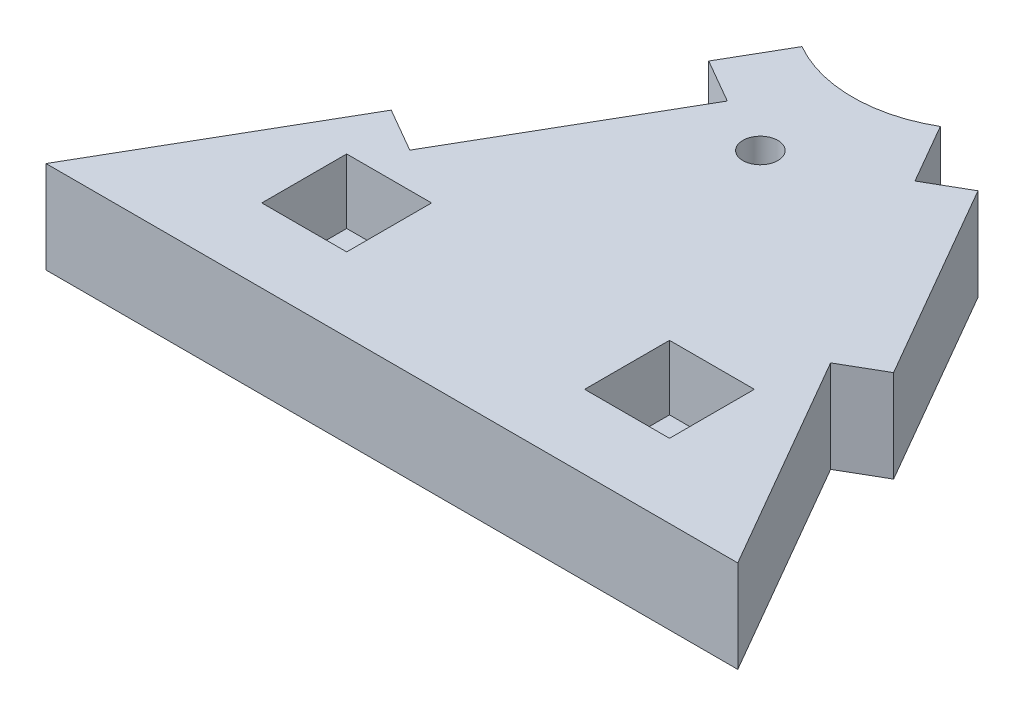
ISO-10303-21;
HEADER;
FILE_DESCRIPTION(('STEP AP214'),'2;1');
FILE_NAME('part.step','',(''),(''),'','','');
FILE_SCHEMA(('AUTOMOTIVE_DESIGN { 1 0 10303 214 1 1 1 1 }'));
ENDSEC;
DATA;
#1=APPLICATION_CONTEXT('core data for automotive mechanical design processes');
#2=APPLICATION_PROTOCOL_DEFINITION('international standard','automotive_design',2000,#1);
#3=PRODUCT_CONTEXT('',#1,'mechanical');
#4=PRODUCT('Part','Part','',(#3));
#5=PRODUCT_RELATED_PRODUCT_CATEGORY('part','',(#4));
#6=PRODUCT_DEFINITION_FORMATION('','',#4);
#7=PRODUCT_DEFINITION_CONTEXT('part definition',#1,'design');
#8=PRODUCT_DEFINITION('design','',#6,#7);
#9=PRODUCT_DEFINITION_SHAPE('','',#8);
#10=(LENGTH_UNIT() NAMED_UNIT(*) SI_UNIT(.MILLI.,.METRE.));
#11=(NAMED_UNIT(*) PLANE_ANGLE_UNIT() SI_UNIT($,.RADIAN.));
#12=(NAMED_UNIT(*) SI_UNIT($,.STERADIAN.) SOLID_ANGLE_UNIT());
#13=UNCERTAINTY_MEASURE_WITH_UNIT(LENGTH_MEASURE(1.E-05),#10,'distance_accuracy_value','');
#14=(GEOMETRIC_REPRESENTATION_CONTEXT(3) GLOBAL_UNCERTAINTY_ASSIGNED_CONTEXT((#13)) GLOBAL_UNIT_ASSIGNED_CONTEXT((#10,
#11,#12)) REPRESENTATION_CONTEXT('',''));
#15=CARTESIAN_POINT('',(0.,0.,0.));
#16=DIRECTION('',(0.,0.,1.));
#17=DIRECTION('',(1.,0.,0.));
#18=AXIS2_PLACEMENT_3D('',#15,#16,#17);
#19=CARTESIAN_POINT('',(75.,10.,0.));
#20=DIRECTION('',(-0.866025403784439,0.,0.5));
#21=DIRECTION('',(0.5,0.,0.866025403784439));
#22=AXIS2_PLACEMENT_3D('',#19,#20,#21);
#23=PLANE('',#22);
#24=DIRECTION('',(-0.5,0.,-0.866025403784439));
#25=VECTOR('',#24,1.);
#26=CARTESIAN_POINT('',(75.,0.,0.));
#27=LINE('',#26,#25);
#28=CARTESIAN_POINT('',(48.75,0.,-45.466333698683));
#29=VERTEX_POINT('',#28);
#30=CARTESIAN_POINT('',(45.,0.,-51.9615242270663));
#31=VERTEX_POINT('',#30);
#32=EDGE_CURVE('E194',#29,#31,#27,.T.);
#33=ORIENTED_EDGE('',*,*,#32,.T.);
#34=DIRECTION('',(0.,1.,0.));
#35=VECTOR('',#34,1.);
#36=CARTESIAN_POINT('',(45.,0.,-51.9615242270663));
#37=LINE('',#36,#35);
#38=CARTESIAN_POINT('',(45.,10.,-51.9615242270663));
#39=VERTEX_POINT('',#38);
#40=EDGE_CURVE('E48',#31,#39,#37,.T.);
#41=ORIENTED_EDGE('',*,*,#40,.T.);
#42=DIRECTION('',(-0.5,0.,-0.866025403784439));
#43=VECTOR('',#42,1.);
#44=CARTESIAN_POINT('',(75.,10.,0.));
#45=LINE('',#44,#43);
#46=CARTESIAN_POINT('',(48.75,10.,-45.466333698683));
#47=VERTEX_POINT('',#46);
#48=EDGE_CURVE('E55',#47,#39,#45,.T.);
#49=ORIENTED_EDGE('',*,*,#48,.F.);
#50=DIRECTION('',(0.,1.,0.));
#51=VECTOR('',#50,1.);
#52=CARTESIAN_POINT('',(48.75,0.,-45.466333698683));
#53=LINE('',#52,#51);
#54=EDGE_CURVE('E298',#29,#47,#53,.T.);
#55=ORIENTED_EDGE('',*,*,#54,.F.);
#56=EDGE_LOOP('',(#33,#41,#49,#55));
#57=FACE_BOUND('',#56,.T.);
#58=ADVANCED_FACE('F33',(#57),#23,.F.);
#59=CARTESIAN_POINT('',(37.5,10.,-64.9519052838329));
#60=DIRECTION('',(0.866025403784439,0.,0.5));
#61=DIRECTION('',(0.5,0.,-0.866025403784439));
#62=AXIS2_PLACEMENT_3D('',#59,#60,#61);
#63=PLANE('',#62);
#64=DIRECTION('',(-0.5,0.,0.866025403784439));
#65=VECTOR('',#64,1.);
#66=CARTESIAN_POINT('',(37.5,10.,-64.9519052838329));
#67=LINE('',#66,#65);
#68=CARTESIAN_POINT('',(30.,10.,-51.9615242270663));
#69=VERTEX_POINT('',#68);
#70=CARTESIAN_POINT('',(26.3,10.,-45.5529362390615));
#71=VERTEX_POINT('',#70);
#72=EDGE_CURVE('E184',#69,#71,#67,.T.);
#73=ORIENTED_EDGE('',*,*,#72,.F.);
#74=DIRECTION('',(0.,1.,0.));
#75=VECTOR('',#74,1.);
#76=CARTESIAN_POINT('',(30.,0.,-51.9615242270663));
#77=LINE('',#76,#75);
#78=CARTESIAN_POINT('',(30.,0.,-51.9615242270663));
#79=VERTEX_POINT('',#78);
#80=EDGE_CURVE('E171',#79,#69,#77,.T.);
#81=ORIENTED_EDGE('',*,*,#80,.F.);
#82=DIRECTION('',(-0.5,0.,0.866025403784439));
#83=VECTOR('',#82,1.);
#84=CARTESIAN_POINT('',(37.5,0.,-64.9519052838329));
#85=LINE('',#84,#83);
#86=CARTESIAN_POINT('',(26.3,0.,-45.5529362390615));
#87=VERTEX_POINT('',#86);
#88=EDGE_CURVE('E182',#79,#87,#85,.T.);
#89=ORIENTED_EDGE('',*,*,#88,.T.);
#90=DIRECTION('',(0.,1.,0.));
#91=VECTOR('',#90,1.);
#92=CARTESIAN_POINT('',(26.3,0.,-45.5529362390615));
#93=LINE('',#92,#91);
#94=EDGE_CURVE('E270',#87,#71,#93,.T.);
#95=ORIENTED_EDGE('',*,*,#94,.T.);
#96=EDGE_LOOP('',(#73,#81,#89,#95));
#97=FACE_BOUND('',#96,.T.);
#98=ADVANCED_FACE('F180',(#97),#63,.F.);
#99=CARTESIAN_POINT('',(13.7,10.,-23.7290960636936));
#100=VERTEX_POINT('',#99);
#101=CARTESIAN_POINT('',(0.,10.,0.));
#102=VERTEX_POINT('',#101);
#103=EDGE_CURVE('E202',#100,#102,#67,.T.);
#104=ORIENTED_EDGE('',*,*,#103,.F.);
#105=DIRECTION('',(0.,1.,0.));
#106=VECTOR('',#105,1.);
#107=CARTESIAN_POINT('',(13.7,0.,-23.7290960636936));
#108=LINE('',#107,#106);
#109=CARTESIAN_POINT('',(13.7,0.,-23.7290960636936));
#110=VERTEX_POINT('',#109);
#111=EDGE_CURVE('E281',#110,#100,#108,.T.);
#112=ORIENTED_EDGE('',*,*,#111,.F.);
#113=CARTESIAN_POINT('',(0.,0.,0.));
#114=VERTEX_POINT('',#113);
#115=EDGE_CURVE('E192',#110,#114,#85,.T.);
#116=ORIENTED_EDGE('',*,*,#115,.T.);
#117=DIRECTION('',(0.,-1.,0.));
#118=VECTOR('',#117,1.);
#119=CARTESIAN_POINT('',(0.,10.,0.));
#120=LINE('',#119,#118);
#121=EDGE_CURVE('E11',#102,#114,#120,.T.);
#122=ORIENTED_EDGE('',*,*,#121,.F.);
#123=EDGE_LOOP('',(#104,#112,#116,#122));
#124=FACE_BOUND('',#123,.T.);
#125=ADVANCED_FACE('F35',(#124),#63,.F.);
#126=CARTESIAN_POINT('',(0.,10.,0.));
#127=DIRECTION('',(0.,0.,-1.));
#128=DIRECTION('',(-1.,0.,0.));
#129=AXIS2_PLACEMENT_3D('',#126,#127,#128);
#130=PLANE('',#129);
#131=DIRECTION('',(1.,0.,0.));
#132=VECTOR('',#131,1.);
#133=CARTESIAN_POINT('',(0.,0.,0.));
#134=LINE('',#133,#132);
#135=CARTESIAN_POINT('',(75.,0.,0.));
#136=VERTEX_POINT('',#135);
#137=EDGE_CURVE('E191',#114,#136,#134,.T.);
#138=ORIENTED_EDGE('',*,*,#137,.T.);
#139=DIRECTION('',(0.,-1.,0.));
#140=VECTOR('',#139,1.);
#141=CARTESIAN_POINT('',(75.,10.,0.));
#142=LINE('',#141,#140);
#143=CARTESIAN_POINT('',(75.,10.,0.));
#144=VERTEX_POINT('',#143);
#145=EDGE_CURVE('E41',#144,#136,#142,.T.);
#146=ORIENTED_EDGE('',*,*,#145,.F.);
#147=DIRECTION('',(1.,0.,0.));
#148=VECTOR('',#147,1.);
#149=CARTESIAN_POINT('',(0.,10.,0.));
#150=LINE('',#149,#148);
#151=EDGE_CURVE('E212',#102,#144,#150,.T.);
#152=ORIENTED_EDGE('',*,*,#151,.F.);
#153=ORIENTED_EDGE('',*,*,#121,.T.);
#154=EDGE_LOOP('',(#138,#146,#152,#153));
#155=FACE_BOUND('',#154,.T.);
#156=ADVANCED_FACE('F385',(#155),#130,.F.);
#157=CARTESIAN_POINT('',(61.25,0.,-23.8156986040721));
#158=VERTEX_POINT('',#157);
#159=EDGE_CURVE('E201',#136,#158,#27,.T.);
#160=ORIENTED_EDGE('',*,*,#159,.T.);
#161=DIRECTION('',(0.,1.,0.));
#162=VECTOR('',#161,1.);
#163=CARTESIAN_POINT('',(61.25,0.,-23.8156986040721));
#164=LINE('',#163,#162);
#165=CARTESIAN_POINT('',(61.25,10.,-23.8156986040721));
#166=VERTEX_POINT('',#165);
#167=EDGE_CURVE('E304',#158,#166,#164,.T.);
#168=ORIENTED_EDGE('',*,*,#167,.T.);
#169=EDGE_CURVE('E198',#144,#166,#45,.T.);
#170=ORIENTED_EDGE('',*,*,#169,.F.);
#171=ORIENTED_EDGE('',*,*,#145,.T.);
#172=EDGE_LOOP('',(#160,#168,#170,#171));
#173=FACE_BOUND('',#172,.T.);
#174=ADVANCED_FACE('F345',(#173),#23,.F.);
#175=CARTESIAN_POINT('',(0.,10.,0.));
#176=DIRECTION('',(0.,1.,0.));
#177=DIRECTION('',(0.,0.,1.));
#178=AXIS2_PLACEMENT_3D('',#175,#176,#177);
#179=PLANE('',#178);
#180=CARTESIAN_POINT('',(37.5000000000003,10.,-39.9519052838329));
#181=DIRECTION('',(0.,1.,0.));
#182=DIRECTION('',(0.,0.,1.));
#183=AXIS2_PLACEMENT_3D('',#180,#181,#182);
#184=CIRCLE('',#183,1.9);
#185=CARTESIAN_POINT('',(37.5000000000003,10.,-38.0519052838329));
#186=VERTEX_POINT('',#185);
#187=EDGE_CURVE('E330',#186,#186,#184,.T.);
#188=ORIENTED_EDGE('',*,*,#187,.F.);
#189=EDGE_LOOP('',(#188));
#190=FACE_BOUND('',#189,.T.);
#191=CARTESIAN_POINT('',(37.5,10.,-64.9519052838329));
#192=DIRECTION('',(0.,1.,0.));
#193=DIRECTION('',(0.,0.,1.));
#194=AXIS2_PLACEMENT_3D('',#191,#192,#193);
#195=CIRCLE('',#194,15.);
#196=EDGE_CURVE('E176',#69,#39,#195,.T.);
#197=ORIENTED_EDGE('',*,*,#196,.F.);
#198=ORIENTED_EDGE('',*,*,#72,.T.);
#199=DIRECTION('',(-0.866025403784438,0.,-0.500000000000001));
#200=VECTOR('',#199,1.);
#201=CARTESIAN_POINT('',(26.3,10.,-45.5529362390615));
#202=LINE('',#201,#200);
#203=CARTESIAN_POINT('',(31.0631397208144,10.,-42.8029362390615));
#204=VERTEX_POINT('',#203);
#205=EDGE_CURVE('E288',#204,#71,#202,.T.);
#206=ORIENTED_EDGE('',*,*,#205,.F.);
#207=DIRECTION('',(0.5,0.,-0.866025403784439));
#208=VECTOR('',#207,1.);
#209=CARTESIAN_POINT('',(31.0631397208144,10.,-42.8029362390615));
#210=LINE('',#209,#208);
#211=CARTESIAN_POINT('',(18.4631397208144,10.,-20.9790960636936));
#212=VERTEX_POINT('',#211);
#213=EDGE_CURVE('E292',#212,#204,#210,.T.);
#214=ORIENTED_EDGE('',*,*,#213,.F.);
#215=DIRECTION('',(0.866025403784438,0.,0.500000000000001));
#216=VECTOR('',#215,1.);
#217=CARTESIAN_POINT('',(18.4631397208144,10.,-20.9790960636936));
#218=LINE('',#217,#216);
#219=EDGE_CURVE('E295',#100,#212,#218,.T.);
#220=ORIENTED_EDGE('',*,*,#219,.F.);
#221=ORIENTED_EDGE('',*,*,#103,.T.);
#222=ORIENTED_EDGE('',*,*,#151,.T.);
#223=ORIENTED_EDGE('',*,*,#169,.T.);
#224=DIRECTION('',(0.866025403784438,0.,-0.500000000000001));
#225=VECTOR('',#224,1.);
#226=CARTESIAN_POINT('',(65.5801270189222,10.,-26.3156986040721));
#227=LINE('',#226,#225);
#228=CARTESIAN_POINT('',(65.5801270189222,10.,-26.3156986040721));
#229=VERTEX_POINT('',#228);
#230=EDGE_CURVE('E318',#166,#229,#227,.T.);
#231=ORIENTED_EDGE('',*,*,#230,.T.);
#232=DIRECTION('',(-0.5,0.,-0.866025403784439));
#233=VECTOR('',#232,1.);
#234=CARTESIAN_POINT('',(53.0801270189222,10.,-47.966333698683));
#235=LINE('',#234,#233);
#236=CARTESIAN_POINT('',(53.0801270189222,10.,-47.966333698683));
#237=VERTEX_POINT('',#236);
#238=EDGE_CURVE('E315',#229,#237,#235,.T.);
#239=ORIENTED_EDGE('',*,*,#238,.T.);
#240=DIRECTION('',(-0.866025403784438,0.,0.500000000000002));
#241=VECTOR('',#240,1.);
#242=CARTESIAN_POINT('',(48.75,10.,-45.466333698683));
#243=LINE('',#242,#241);
#244=EDGE_CURVE('E312',#237,#47,#243,.T.);
#245=ORIENTED_EDGE('',*,*,#244,.T.);
#246=ORIENTED_EDGE('',*,*,#48,.T.);
#247=EDGE_LOOP('',(#197,#198,#206,#214,#220,#221,#222,#223,#231,#239,#245,#246));
#248=FACE_BOUND('',#247,.T.);
#249=DIRECTION('',(1.,0.,0.));
#250=VECTOR('',#249,1.);
#251=CARTESIAN_POINT('',(59.6,10.,-8.00000000000001));
#252=LINE('',#251,#250);
#253=CARTESIAN_POINT('',(50.4,10.,-8.));
#254=VERTEX_POINT('',#253);
#255=CARTESIAN_POINT('',(59.6,10.,-8.00000000000001));
#256=VERTEX_POINT('',#255);
#257=EDGE_CURVE('E268',#254,#256,#252,.T.);
#258=ORIENTED_EDGE('',*,*,#257,.F.);
#259=DIRECTION('',(0.,0.,1.));
#260=VECTOR('',#259,1.);
#261=CARTESIAN_POINT('',(50.4,10.,-8.));
#262=LINE('',#261,#260);
#263=CARTESIAN_POINT('',(50.4,10.,-17.2));
#264=VERTEX_POINT('',#263);
#265=EDGE_CURVE('E258',#264,#254,#262,.T.);
#266=ORIENTED_EDGE('',*,*,#265,.F.);
#267=DIRECTION('',(-1.,0.,0.));
#268=VECTOR('',#267,1.);
#269=CARTESIAN_POINT('',(59.6,10.,-17.2));
#270=LINE('',#269,#268);
#271=CARTESIAN_POINT('',(59.6,10.,-17.2));
#272=VERTEX_POINT('',#271);
#273=EDGE_CURVE('E262',#272,#264,#270,.T.);
#274=ORIENTED_EDGE('',*,*,#273,.F.);
#275=DIRECTION('',(0.,0.,-1.));
#276=VECTOR('',#275,1.);
#277=CARTESIAN_POINT('',(59.6,10.,-8.00000000000001));
#278=LINE('',#277,#276);
#279=EDGE_CURVE('E265',#256,#272,#278,.T.);
#280=ORIENTED_EDGE('',*,*,#279,.F.);
#281=EDGE_LOOP('',(#258,#266,#274,#280));
#282=FACE_BOUND('',#281,.T.);
#283=DIRECTION('',(0.,0.,-1.));
#284=VECTOR('',#283,1.);
#285=CARTESIAN_POINT('',(24.6,10.,-8.));
#286=LINE('',#285,#284);
#287=CARTESIAN_POINT('',(24.6,10.,-8.));
#288=VERTEX_POINT('',#287);
#289=CARTESIAN_POINT('',(24.6,10.,-17.2));
#290=VERTEX_POINT('',#289);
#291=EDGE_CURVE('E236',#288,#290,#286,.T.);
#292=ORIENTED_EDGE('',*,*,#291,.F.);
#293=DIRECTION('',(1.,0.,0.));
#294=VECTOR('',#293,1.);
#295=CARTESIAN_POINT('',(15.4,10.,-8.));
#296=LINE('',#295,#294);
#297=CARTESIAN_POINT('',(15.4,10.,-8.));
#298=VERTEX_POINT('',#297);
#299=EDGE_CURVE('E226',#298,#288,#296,.T.);
#300=ORIENTED_EDGE('',*,*,#299,.F.);
#301=DIRECTION('',(0.,0.,1.));
#302=VECTOR('',#301,1.);
#303=CARTESIAN_POINT('',(15.4,10.,-8.));
#304=LINE('',#303,#302);
#305=CARTESIAN_POINT('',(15.4,10.,-17.2));
#306=VERTEX_POINT('',#305);
#307=EDGE_CURVE('E230',#306,#298,#304,.T.);
#308=ORIENTED_EDGE('',*,*,#307,.F.);
#309=DIRECTION('',(-1.,0.,0.));
#310=VECTOR('',#309,1.);
#311=CARTESIAN_POINT('',(15.4,10.,-17.2));
#312=LINE('',#311,#310);
#313=EDGE_CURVE('E233',#290,#306,#312,.T.);
#314=ORIENTED_EDGE('',*,*,#313,.F.);
#315=EDGE_LOOP('',(#292,#300,#308,#314));
#316=FACE_BOUND('',#315,.T.);
#317=ADVANCED_FACE('F343',(#190,#248,#282,#316),#179,.T.);
#318=CARTESIAN_POINT('',(0.,0.,0.));
#319=DIRECTION('',(0.,1.,0.));
#320=DIRECTION('',(0.,0.,1.));
#321=AXIS2_PLACEMENT_3D('',#318,#319,#320);
#322=PLANE('',#321);
#323=CARTESIAN_POINT('',(37.5000000000003,0.,-39.9519052838329));
#324=DIRECTION('',(0.,1.,0.));
#325=DIRECTION('',(0.,0.,1.));
#326=AXIS2_PLACEMENT_3D('',#323,#324,#325);
#327=CIRCLE('',#326,1.9);
#328=CARTESIAN_POINT('',(37.5000000000003,0.,-38.0519052838329));
#329=VERTEX_POINT('',#328);
#330=EDGE_CURVE('E328',#329,#329,#327,.T.);
#331=ORIENTED_EDGE('',*,*,#330,.T.);
#332=EDGE_LOOP('',(#331));
#333=FACE_BOUND('',#332,.T.);
#334=ORIENTED_EDGE('',*,*,#88,.F.);
#335=CARTESIAN_POINT('',(37.5,0.,-64.9519052838329));
#336=DIRECTION('',(0.,1.,0.));
#337=DIRECTION('',(0.,0.,1.));
#338=AXIS2_PLACEMENT_3D('',#335,#336,#337);
#339=CIRCLE('',#338,15.);
#340=EDGE_CURVE('E168',#79,#31,#339,.T.);
#341=ORIENTED_EDGE('',*,*,#340,.T.);
#342=ORIENTED_EDGE('',*,*,#32,.F.);
#343=DIRECTION('',(-0.866025403784438,0.,0.500000000000002));
#344=VECTOR('',#343,1.);
#345=CARTESIAN_POINT('',(48.75,0.,-45.466333698683));
#346=LINE('',#345,#344);
#347=CARTESIAN_POINT('',(53.0801270189222,0.,-47.966333698683));
#348=VERTEX_POINT('',#347);
#349=EDGE_CURVE('E307',#348,#29,#346,.T.);
#350=ORIENTED_EDGE('',*,*,#349,.F.);
#351=DIRECTION('',(-0.5,0.,-0.866025403784439));
#352=VECTOR('',#351,1.);
#353=CARTESIAN_POINT('',(53.0801270189222,0.,-47.966333698683));
#354=LINE('',#353,#352);
#355=CARTESIAN_POINT('',(65.5801270189222,0.,-26.3156986040721));
#356=VERTEX_POINT('',#355);
#357=EDGE_CURVE('E322',#356,#348,#354,.T.);
#358=ORIENTED_EDGE('',*,*,#357,.F.);
#359=DIRECTION('',(0.866025403784438,0.,-0.500000000000001));
#360=VECTOR('',#359,1.);
#361=CARTESIAN_POINT('',(65.5801270189222,0.,-26.3156986040721));
#362=LINE('',#361,#360);
#363=EDGE_CURVE('E314',#158,#356,#362,.T.);
#364=ORIENTED_EDGE('',*,*,#363,.F.);
#365=ORIENTED_EDGE('',*,*,#159,.F.);
#366=ORIENTED_EDGE('',*,*,#137,.F.);
#367=ORIENTED_EDGE('',*,*,#115,.F.);
#368=DIRECTION('',(0.866025403784438,0.,0.500000000000001));
#369=VECTOR('',#368,1.);
#370=CARTESIAN_POINT('',(18.4631397208144,0.,-20.9790960636936));
#371=LINE('',#370,#369);
#372=CARTESIAN_POINT('',(18.4631397208144,0.,-20.9790960636936));
#373=VERTEX_POINT('',#372);
#374=EDGE_CURVE('E291',#110,#373,#371,.T.);
#375=ORIENTED_EDGE('',*,*,#374,.T.);
#376=DIRECTION('',(0.5,0.,-0.866025403784439));
#377=VECTOR('',#376,1.);
#378=CARTESIAN_POINT('',(31.0631397208144,0.,-42.8029362390615));
#379=LINE('',#378,#377);
#380=CARTESIAN_POINT('',(31.0631397208144,0.,-42.8029362390615));
#381=VERTEX_POINT('',#380);
#382=EDGE_CURVE('E300',#373,#381,#379,.T.);
#383=ORIENTED_EDGE('',*,*,#382,.T.);
#384=DIRECTION('',(-0.866025403784438,0.,-0.500000000000001));
#385=VECTOR('',#384,1.);
#386=CARTESIAN_POINT('',(26.3,0.,-45.5529362390615));
#387=LINE('',#386,#385);
#388=EDGE_CURVE('E190',#381,#87,#387,.T.);
#389=ORIENTED_EDGE('',*,*,#388,.T.);
#390=EDGE_LOOP('',(#334,#341,#342,#350,#358,#364,#365,#366,#367,#375,#383,#389));
#391=FACE_BOUND('',#390,.T.);
#392=ADVANCED_FACE('F187',(#333,#391),#322,.F.);
#393=CARTESIAN_POINT('',(24.6,3.,-8.));
#394=DIRECTION('',(1.,0.,0.));
#395=DIRECTION('',(0.,0.,-1.));
#396=AXIS2_PLACEMENT_3D('',#393,#394,#395);
#397=PLANE('',#396);
#398=ORIENTED_EDGE('',*,*,#291,.T.);
#399=DIRECTION('',(0.,1.,0.));
#400=VECTOR('',#399,1.);
#401=CARTESIAN_POINT('',(24.6,3.,-17.2));
#402=LINE('',#401,#400);
#403=CARTESIAN_POINT('',(24.6,3.,-17.2));
#404=VERTEX_POINT('',#403);
#405=EDGE_CURVE('E217',#404,#290,#402,.T.);
#406=ORIENTED_EDGE('',*,*,#405,.F.);
#407=DIRECTION('',(0.,0.,-1.));
#408=VECTOR('',#407,1.);
#409=CARTESIAN_POINT('',(24.6,3.,-8.));
#410=LINE('',#409,#408);
#411=CARTESIAN_POINT('',(24.6,3.,-8.));
#412=VERTEX_POINT('',#411);
#413=EDGE_CURVE('E229',#412,#404,#410,.T.);
#414=ORIENTED_EDGE('',*,*,#413,.F.);
#415=DIRECTION('',(0.,1.,0.));
#416=VECTOR('',#415,1.);
#417=CARTESIAN_POINT('',(24.6,3.,-8.));
#418=LINE('',#417,#416);
#419=EDGE_CURVE('E196',#412,#288,#418,.T.);
#420=ORIENTED_EDGE('',*,*,#419,.T.);
#421=EDGE_LOOP('',(#398,#406,#414,#420));
#422=FACE_BOUND('',#421,.T.);
#423=ADVANCED_FACE('F357',(#422),#397,.F.);
#424=CARTESIAN_POINT('',(15.4,3.,-8.));
#425=DIRECTION('',(0.,0.,1.));
#426=DIRECTION('',(1.,0.,0.));
#427=AXIS2_PLACEMENT_3D('',#424,#425,#426);
#428=PLANE('',#427);
#429=ORIENTED_EDGE('',*,*,#299,.T.);
#430=ORIENTED_EDGE('',*,*,#419,.F.);
#431=DIRECTION('',(1.,0.,0.));
#432=VECTOR('',#431,1.);
#433=CARTESIAN_POINT('',(15.4,3.,-8.));
#434=LINE('',#433,#432);
#435=CARTESIAN_POINT('',(15.4,3.,-8.));
#436=VERTEX_POINT('',#435);
#437=EDGE_CURVE('E221',#436,#412,#434,.T.);
#438=ORIENTED_EDGE('',*,*,#437,.F.);
#439=DIRECTION('',(0.,1.,0.));
#440=VECTOR('',#439,1.);
#441=CARTESIAN_POINT('',(15.4,3.,-8.));
#442=LINE('',#441,#440);
#443=EDGE_CURVE('E223',#436,#298,#442,.T.);
#444=ORIENTED_EDGE('',*,*,#443,.T.);
#445=EDGE_LOOP('',(#429,#430,#438,#444));
#446=FACE_BOUND('',#445,.T.);
#447=ADVANCED_FACE('F367',(#446),#428,.F.);
#448=CARTESIAN_POINT('',(15.4,3.,-8.));
#449=DIRECTION('',(-1.,0.,0.));
#450=DIRECTION('',(0.,0.,1.));
#451=AXIS2_PLACEMENT_3D('',#448,#449,#450);
#452=PLANE('',#451);
#453=ORIENTED_EDGE('',*,*,#307,.T.);
#454=ORIENTED_EDGE('',*,*,#443,.F.);
#455=DIRECTION('',(0.,0.,1.));
#456=VECTOR('',#455,1.);
#457=CARTESIAN_POINT('',(15.4,3.,-8.));
#458=LINE('',#457,#456);
#459=CARTESIAN_POINT('',(15.4,3.,-17.2));
#460=VERTEX_POINT('',#459);
#461=EDGE_CURVE('E241',#460,#436,#458,.T.);
#462=ORIENTED_EDGE('',*,*,#461,.F.);
#463=DIRECTION('',(0.,1.,0.));
#464=VECTOR('',#463,1.);
#465=CARTESIAN_POINT('',(15.4,3.,-17.2));
#466=LINE('',#465,#464);
#467=EDGE_CURVE('E220',#460,#306,#466,.T.);
#468=ORIENTED_EDGE('',*,*,#467,.T.);
#469=EDGE_LOOP('',(#453,#454,#462,#468));
#470=FACE_BOUND('',#469,.T.);
#471=ADVANCED_FACE('F369',(#470),#452,.F.);
#472=CARTESIAN_POINT('',(15.4,3.,-17.2));
#473=DIRECTION('',(0.,0.,-1.));
#474=DIRECTION('',(-1.,0.,0.));
#475=AXIS2_PLACEMENT_3D('',#472,#473,#474);
#476=PLANE('',#475);
#477=ORIENTED_EDGE('',*,*,#313,.T.);
#478=ORIENTED_EDGE('',*,*,#467,.F.);
#479=DIRECTION('',(-1.,0.,0.));
#480=VECTOR('',#479,1.);
#481=CARTESIAN_POINT('',(15.4,3.,-17.2));
#482=LINE('',#481,#480);
#483=EDGE_CURVE('E244',#404,#460,#482,.T.);
#484=ORIENTED_EDGE('',*,*,#483,.F.);
#485=ORIENTED_EDGE('',*,*,#405,.T.);
#486=EDGE_LOOP('',(#477,#478,#484,#485));
#487=FACE_BOUND('',#486,.T.);
#488=ADVANCED_FACE('F361',(#487),#476,.F.);
#489=CARTESIAN_POINT('',(0.,3.,0.));
#490=DIRECTION('',(0.,-1.,0.));
#491=DIRECTION('',(0.,0.,-1.));
#492=AXIS2_PLACEMENT_3D('',#489,#490,#491);
#493=PLANE('',#492);
#494=ORIENTED_EDGE('',*,*,#413,.T.);
#495=ORIENTED_EDGE('',*,*,#483,.T.);
#496=ORIENTED_EDGE('',*,*,#461,.T.);
#497=ORIENTED_EDGE('',*,*,#437,.T.);
#498=EDGE_LOOP('',(#494,#495,#496,#497));
#499=FACE_BOUND('',#498,.T.);
#500=ADVANCED_FACE('F364',(#499),#493,.F.);
#501=CARTESIAN_POINT('',(59.6,3.,-8.00000000000001));
#502=DIRECTION('',(0.,0.,1.));
#503=DIRECTION('',(1.,0.,0.));
#504=AXIS2_PLACEMENT_3D('',#501,#502,#503);
#505=PLANE('',#504);
#506=ORIENTED_EDGE('',*,*,#257,.T.);
#507=DIRECTION('',(0.,1.,0.));
#508=VECTOR('',#507,1.);
#509=CARTESIAN_POINT('',(59.6,3.,-8.00000000000001));
#510=LINE('',#509,#508);
#511=CARTESIAN_POINT('',(59.6,3.,-8.00000000000001));
#512=VERTEX_POINT('',#511);
#513=EDGE_CURVE('E249',#512,#256,#510,.T.);
#514=ORIENTED_EDGE('',*,*,#513,.F.);
#515=DIRECTION('',(1.,0.,0.));
#516=VECTOR('',#515,1.);
#517=CARTESIAN_POINT('',(59.6,3.,-8.00000000000001));
#518=LINE('',#517,#516);
#519=CARTESIAN_POINT('',(50.4,3.,-8.));
#520=VERTEX_POINT('',#519);
#521=EDGE_CURVE('E261',#520,#512,#518,.T.);
#522=ORIENTED_EDGE('',*,*,#521,.F.);
#523=DIRECTION('',(0.,1.,0.));
#524=VECTOR('',#523,1.);
#525=CARTESIAN_POINT('',(50.4,3.,-8.));
#526=LINE('',#525,#524);
#527=EDGE_CURVE('E238',#520,#254,#526,.T.);
#528=ORIENTED_EDGE('',*,*,#527,.T.);
#529=EDGE_LOOP('',(#506,#514,#522,#528));
#530=FACE_BOUND('',#529,.T.);
#531=ADVANCED_FACE('F434',(#530),#505,.F.);
#532=CARTESIAN_POINT('',(50.4,3.,-8.));
#533=DIRECTION('',(-1.,0.,0.));
#534=DIRECTION('',(0.,0.,1.));
#535=AXIS2_PLACEMENT_3D('',#532,#533,#534);
#536=PLANE('',#535);
#537=ORIENTED_EDGE('',*,*,#265,.T.);
#538=ORIENTED_EDGE('',*,*,#527,.F.);
#539=DIRECTION('',(0.,0.,1.));
#540=VECTOR('',#539,1.);
#541=CARTESIAN_POINT('',(50.4,3.,-8.));
#542=LINE('',#541,#540);
#543=CARTESIAN_POINT('',(50.4,3.,-17.2));
#544=VERTEX_POINT('',#543);
#545=EDGE_CURVE('E253',#544,#520,#542,.T.);
#546=ORIENTED_EDGE('',*,*,#545,.F.);
#547=DIRECTION('',(0.,1.,0.));
#548=VECTOR('',#547,1.);
#549=CARTESIAN_POINT('',(50.4,3.,-17.2));
#550=LINE('',#549,#548);
#551=EDGE_CURVE('E255',#544,#264,#550,.T.);
#552=ORIENTED_EDGE('',*,*,#551,.T.);
#553=EDGE_LOOP('',(#537,#538,#546,#552));
#554=FACE_BOUND('',#553,.T.);
#555=ADVANCED_FACE('F430',(#554),#536,.F.);
#556=CARTESIAN_POINT('',(59.6,3.,-17.2));
#557=DIRECTION('',(0.,0.,-1.));
#558=DIRECTION('',(-1.,0.,0.));
#559=AXIS2_PLACEMENT_3D('',#556,#557,#558);
#560=PLANE('',#559);
#561=ORIENTED_EDGE('',*,*,#273,.T.);
#562=ORIENTED_EDGE('',*,*,#551,.F.);
#563=DIRECTION('',(-1.,0.,0.));
#564=VECTOR('',#563,1.);
#565=CARTESIAN_POINT('',(59.6,3.,-17.2));
#566=LINE('',#565,#564);
#567=CARTESIAN_POINT('',(59.6,3.,-17.2));
#568=VERTEX_POINT('',#567);
#569=EDGE_CURVE('E273',#568,#544,#566,.T.);
#570=ORIENTED_EDGE('',*,*,#569,.F.);
#571=DIRECTION('',(0.,1.,0.));
#572=VECTOR('',#571,1.);
#573=CARTESIAN_POINT('',(59.6,3.,-17.2));
#574=LINE('',#573,#572);
#575=EDGE_CURVE('E252',#568,#272,#574,.T.);
#576=ORIENTED_EDGE('',*,*,#575,.T.);
#577=EDGE_LOOP('',(#561,#562,#570,#576));
#578=FACE_BOUND('',#577,.T.);
#579=ADVANCED_FACE('F433',(#578),#560,.F.);
#580=CARTESIAN_POINT('',(59.6,3.,-8.00000000000001));
#581=DIRECTION('',(1.,0.,0.));
#582=DIRECTION('',(0.,0.,-1.));
#583=AXIS2_PLACEMENT_3D('',#580,#581,#582);
#584=PLANE('',#583);
#585=ORIENTED_EDGE('',*,*,#279,.T.);
#586=ORIENTED_EDGE('',*,*,#575,.F.);
#587=DIRECTION('',(0.,0.,-1.));
#588=VECTOR('',#587,1.);
#589=CARTESIAN_POINT('',(59.6,3.,-8.00000000000001));
#590=LINE('',#589,#588);
#591=EDGE_CURVE('E276',#512,#568,#590,.T.);
#592=ORIENTED_EDGE('',*,*,#591,.F.);
#593=ORIENTED_EDGE('',*,*,#513,.T.);
#594=EDGE_LOOP('',(#585,#586,#592,#593));
#595=FACE_BOUND('',#594,.T.);
#596=ADVANCED_FACE('F428',(#595),#584,.F.);
#597=CARTESIAN_POINT('',(0.,3.,0.));
#598=DIRECTION('',(0.,-1.,0.));
#599=DIRECTION('',(0.,0.,-1.));
#600=AXIS2_PLACEMENT_3D('',#597,#598,#599);
#601=PLANE('',#600);
#602=ORIENTED_EDGE('',*,*,#521,.T.);
#603=ORIENTED_EDGE('',*,*,#591,.T.);
#604=ORIENTED_EDGE('',*,*,#569,.T.);
#605=ORIENTED_EDGE('',*,*,#545,.T.);
#606=EDGE_LOOP('',(#602,#603,#604,#605));
#607=FACE_BOUND('',#606,.T.);
#608=ADVANCED_FACE('F421',(#607),#601,.F.);
#609=CARTESIAN_POINT('',(26.3,0.,-45.5529362390615));
#610=DIRECTION('',(0.500000000000001,0.,-0.866025403784438));
#611=DIRECTION('',(-0.866025403784438,0.,-0.500000000000001));
#612=AXIS2_PLACEMENT_3D('',#609,#610,#611);
#613=PLANE('',#612);
#614=ORIENTED_EDGE('',*,*,#205,.T.);
#615=ORIENTED_EDGE('',*,*,#94,.F.);
#616=ORIENTED_EDGE('',*,*,#388,.F.);
#617=DIRECTION('',(0.,1.,0.));
#618=VECTOR('',#617,1.);
#619=CARTESIAN_POINT('',(31.0631397208144,0.,-42.8029362390615));
#620=LINE('',#619,#618);
#621=EDGE_CURVE('E285',#381,#204,#620,.T.);
#622=ORIENTED_EDGE('',*,*,#621,.T.);
#623=EDGE_LOOP('',(#614,#615,#616,#622));
#624=FACE_BOUND('',#623,.T.);
#625=ADVANCED_FACE('F418',(#624),#613,.F.);
#626=CARTESIAN_POINT('',(31.0631397208144,0.,-42.8029362390615));
#627=DIRECTION('',(0.866025403784439,0.,0.5));
#628=DIRECTION('',(0.5,0.,-0.866025403784439));
#629=AXIS2_PLACEMENT_3D('',#626,#627,#628);
#630=PLANE('',#629);
#631=ORIENTED_EDGE('',*,*,#213,.T.);
#632=ORIENTED_EDGE('',*,*,#621,.F.);
#633=ORIENTED_EDGE('',*,*,#382,.F.);
#634=DIRECTION('',(0.,1.,0.));
#635=VECTOR('',#634,1.);
#636=CARTESIAN_POINT('',(18.4631397208144,0.,-20.9790960636936));
#637=LINE('',#636,#635);
#638=EDGE_CURVE('E283',#373,#212,#637,.T.);
#639=ORIENTED_EDGE('',*,*,#638,.T.);
#640=EDGE_LOOP('',(#631,#632,#633,#639));
#641=FACE_BOUND('',#640,.T.);
#642=ADVANCED_FACE('F411',(#641),#630,.F.);
#643=CARTESIAN_POINT('',(18.4631397208144,0.,-20.9790960636936));
#644=DIRECTION('',(-0.500000000000001,0.,0.866025403784438));
#645=DIRECTION('',(0.866025403784438,0.,0.500000000000001));
#646=AXIS2_PLACEMENT_3D('',#643,#644,#645);
#647=PLANE('',#646);
#648=ORIENTED_EDGE('',*,*,#219,.T.);
#649=ORIENTED_EDGE('',*,*,#638,.F.);
#650=ORIENTED_EDGE('',*,*,#374,.F.);
#651=ORIENTED_EDGE('',*,*,#111,.T.);
#652=EDGE_LOOP('',(#648,#649,#650,#651));
#653=FACE_BOUND('',#652,.T.);
#654=ADVANCED_FACE('F404',(#653),#647,.F.);
#655=CARTESIAN_POINT('',(48.75,0.,-45.466333698683));
#656=DIRECTION('',(-0.500000000000002,0.,-0.866025403784438));
#657=DIRECTION('',(-0.866025403784438,0.,0.500000000000002));
#658=AXIS2_PLACEMENT_3D('',#655,#656,#657);
#659=PLANE('',#658);
#660=ORIENTED_EDGE('',*,*,#244,.F.);
#661=DIRECTION('',(0.,1.,0.));
#662=VECTOR('',#661,1.);
#663=CARTESIAN_POINT('',(53.0801270189222,0.,-47.966333698683));
#664=LINE('',#663,#662);
#665=EDGE_CURVE('E309',#348,#237,#664,.T.);
#666=ORIENTED_EDGE('',*,*,#665,.F.);
#667=ORIENTED_EDGE('',*,*,#349,.T.);
#668=ORIENTED_EDGE('',*,*,#54,.T.);
#669=EDGE_LOOP('',(#660,#666,#667,#668));
#670=FACE_BOUND('',#669,.T.);
#671=ADVANCED_FACE('F402',(#670),#659,.T.);
#672=CARTESIAN_POINT('',(53.0801270189222,0.,-47.966333698683));
#673=DIRECTION('',(0.866025403784439,0.,-0.5));
#674=DIRECTION('',(-0.5,0.,-0.866025403784439));
#675=AXIS2_PLACEMENT_3D('',#672,#673,#674);
#676=PLANE('',#675);
#677=ORIENTED_EDGE('',*,*,#238,.F.);
#678=DIRECTION('',(0.,1.,0.));
#679=VECTOR('',#678,1.);
#680=CARTESIAN_POINT('',(65.5801270189222,0.,-26.3156986040721));
#681=LINE('',#680,#679);
#682=EDGE_CURVE('E306',#356,#229,#681,.T.);
#683=ORIENTED_EDGE('',*,*,#682,.F.);
#684=ORIENTED_EDGE('',*,*,#357,.T.);
#685=ORIENTED_EDGE('',*,*,#665,.T.);
#686=EDGE_LOOP('',(#677,#683,#684,#685));
#687=FACE_BOUND('',#686,.T.);
#688=ADVANCED_FACE('F399',(#687),#676,.T.);
#689=CARTESIAN_POINT('',(65.5801270189222,0.,-26.3156986040721));
#690=DIRECTION('',(0.500000000000001,0.,0.866025403784438));
#691=DIRECTION('',(0.866025403784438,0.,-0.500000000000001));
#692=AXIS2_PLACEMENT_3D('',#689,#690,#691);
#693=PLANE('',#692);
#694=ORIENTED_EDGE('',*,*,#230,.F.);
#695=ORIENTED_EDGE('',*,*,#167,.F.);
#696=ORIENTED_EDGE('',*,*,#363,.T.);
#697=ORIENTED_EDGE('',*,*,#682,.T.);
#698=EDGE_LOOP('',(#694,#695,#696,#697));
#699=FACE_BOUND('',#698,.T.);
#700=ADVANCED_FACE('F394',(#699),#693,.T.);
#701=CARTESIAN_POINT('',(37.5,0.,-64.9519052838329));
#702=DIRECTION('',(0.,1.,0.));
#703=DIRECTION('',(0.,0.,1.));
#704=AXIS2_PLACEMENT_3D('',#701,#702,#703);
#705=CYLINDRICAL_SURFACE('',#704,15.);
#706=ORIENTED_EDGE('',*,*,#196,.T.);
#707=ORIENTED_EDGE('',*,*,#40,.F.);
#708=ORIENTED_EDGE('',*,*,#340,.F.);
#709=ORIENTED_EDGE('',*,*,#80,.T.);
#710=EDGE_LOOP('',(#706,#707,#708,#709));
#711=FACE_BOUND('',#710,.T.);
#712=ADVANCED_FACE('F170',(#711),#705,.F.);
#713=CARTESIAN_POINT('',(37.5000000000003,0.,-39.9519052838329));
#714=DIRECTION('',(0.,1.,0.));
#715=DIRECTION('',(0.,0.,1.));
#716=AXIS2_PLACEMENT_3D('',#713,#714,#715);
#717=CYLINDRICAL_SURFACE('',#716,1.9);
#718=ORIENTED_EDGE('',*,*,#330,.F.);
#719=EDGE_LOOP('',(#718));
#720=FACE_BOUND('',#719,.T.);
#721=ORIENTED_EDGE('',*,*,#187,.T.);
#722=EDGE_LOOP('',(#721));
#723=FACE_BOUND('',#722,.T.);
#724=ADVANCED_FACE('F337',(#720,#723),#717,.F.);
#725=CLOSED_SHELL('',(#58,#98,#125,#156,#174,#317,#392,#423,#447,#471,#488,#500,#531,#555,#579,
#596,#608,#625,#642,#654,#671,#688,#700,#712,#724));
#726=MANIFOLD_SOLID_BREP('B2',#725);
#727=ADVANCED_BREP_SHAPE_REPRESENTATION('',(#18,#726),#14);
#728=SHAPE_DEFINITION_REPRESENTATION(#9,#727);
ENDSEC;
END-ISO-10303-21;
